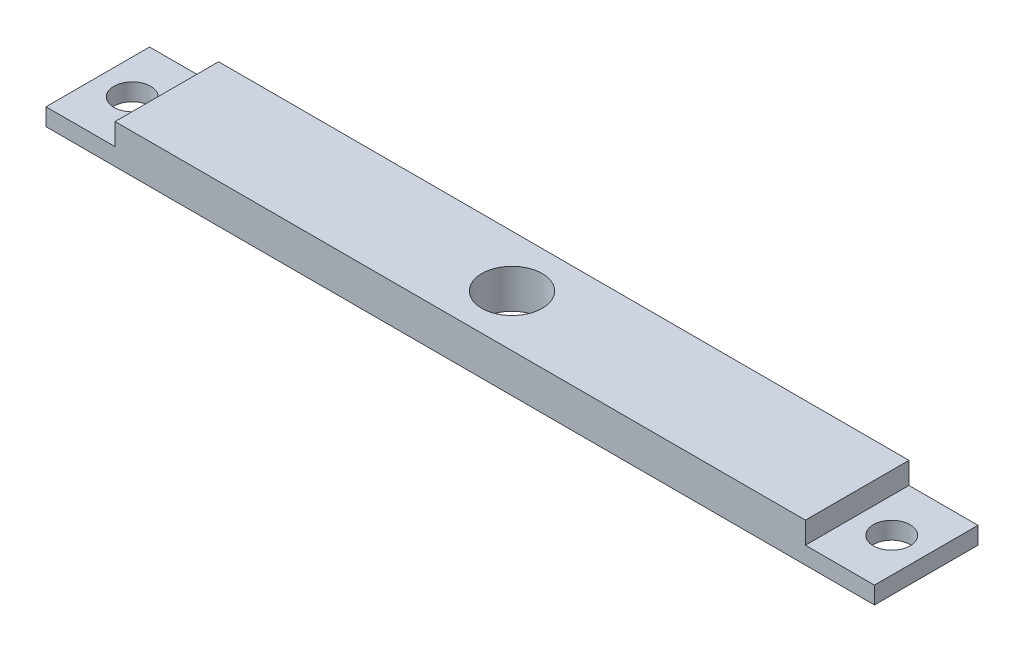
ISO-10303-21;
HEADER;
FILE_DESCRIPTION(('STEP AP214'),'2;1');
FILE_NAME('part.step','',(''),(''),'','','');
FILE_SCHEMA(('AUTOMOTIVE_DESIGN { 1 0 10303 214 1 1 1 1 }'));
ENDSEC;
DATA;
#1=APPLICATION_CONTEXT('core data for automotive mechanical design processes');
#2=APPLICATION_PROTOCOL_DEFINITION('international standard','automotive_design',2000,#1);
#3=PRODUCT_CONTEXT('',#1,'mechanical');
#4=PRODUCT('Part','Part','',(#3));
#5=PRODUCT_RELATED_PRODUCT_CATEGORY('part','',(#4));
#6=PRODUCT_DEFINITION_FORMATION('','',#4);
#7=PRODUCT_DEFINITION_CONTEXT('part definition',#1,'design');
#8=PRODUCT_DEFINITION('design','',#6,#7);
#9=PRODUCT_DEFINITION_SHAPE('','',#8);
#10=(LENGTH_UNIT() NAMED_UNIT(*) SI_UNIT(.MILLI.,.METRE.));
#11=(NAMED_UNIT(*) PLANE_ANGLE_UNIT() SI_UNIT($,.RADIAN.));
#12=(NAMED_UNIT(*) SI_UNIT($,.STERADIAN.) SOLID_ANGLE_UNIT());
#13=UNCERTAINTY_MEASURE_WITH_UNIT(LENGTH_MEASURE(1.E-05),#10,'distance_accuracy_value','');
#14=(GEOMETRIC_REPRESENTATION_CONTEXT(3) GLOBAL_UNCERTAINTY_ASSIGNED_CONTEXT((#13)) GLOBAL_UNIT_ASSIGNED_CONTEXT((#10,
#11,#12)) REPRESENTATION_CONTEXT('',''));
#15=CARTESIAN_POINT('',(0.,0.,0.));
#16=DIRECTION('',(0.,0.,1.));
#17=DIRECTION('',(1.,0.,0.));
#18=AXIS2_PLACEMENT_3D('',#15,#16,#17);
#19=CARTESIAN_POINT('',(-76.2,3.175,19.05));
#20=DIRECTION('',(1.,0.,0.));
#21=DIRECTION('',(0.,0.,-1.));
#22=AXIS2_PLACEMENT_3D('',#19,#20,#21);
#23=PLANE('',#22);
#24=DIRECTION('',(0.,-1.,0.));
#25=VECTOR('',#24,1.);
#26=CARTESIAN_POINT('',(-76.2,3.175,0.));
#27=LINE('',#26,#25);
#28=CARTESIAN_POINT('',(-76.2,3.175,0.));
#29=VERTEX_POINT('',#28);
#30=CARTESIAN_POINT('',(-76.2,0.,0.));
#31=VERTEX_POINT('',#30);
#32=EDGE_CURVE('E128',#29,#31,#27,.T.);
#33=ORIENTED_EDGE('',*,*,#32,.T.);
#34=DIRECTION('',(0.,0.,-1.));
#35=VECTOR('',#34,1.);
#36=CARTESIAN_POINT('',(-76.2,0.,19.05));
#37=LINE('',#36,#35);
#38=CARTESIAN_POINT('',(-76.2,0.,19.05));
#39=VERTEX_POINT('',#38);
#40=EDGE_CURVE('E11',#39,#31,#37,.T.);
#41=ORIENTED_EDGE('',*,*,#40,.F.);
#42=DIRECTION('',(0.,-1.,0.));
#43=VECTOR('',#42,1.);
#44=CARTESIAN_POINT('',(-76.2,3.175,19.05));
#45=LINE('',#44,#43);
#46=CARTESIAN_POINT('',(-76.2,3.175,19.05));
#47=VERTEX_POINT('',#46);
#48=EDGE_CURVE('E143',#47,#39,#45,.T.);
#49=ORIENTED_EDGE('',*,*,#48,.F.);
#50=DIRECTION('',(0.,0.,-1.));
#51=VECTOR('',#50,1.);
#52=CARTESIAN_POINT('',(-76.2,3.175,19.05));
#53=LINE('',#52,#51);
#54=EDGE_CURVE('E124',#47,#29,#53,.T.);
#55=ORIENTED_EDGE('',*,*,#54,.T.);
#56=EDGE_LOOP('',(#33,#41,#49,#55));
#57=FACE_BOUND('',#56,.T.);
#58=ADVANCED_FACE('F32',(#57),#23,.F.);
#59=CARTESIAN_POINT('',(-76.2,0.,19.05));
#60=DIRECTION('',(0.,1.,0.));
#61=DIRECTION('',(-1.,0.,0.));
#62=AXIS2_PLACEMENT_3D('',#59,#60,#61);
#63=PLANE('',#62);
#64=CARTESIAN_POINT('',(69.85,0.,9.525));
#65=DIRECTION('',(0.,1.,0.));
#66=DIRECTION('',(-1.,0.,0.));
#67=AXIS2_PLACEMENT_3D('',#64,#65,#66);
#68=CIRCLE('',#67,3.37819999999999);
#69=CARTESIAN_POINT('',(66.4718,0.,9.525));
#70=VERTEX_POINT('',#69);
#71=EDGE_CURVE('E185',#70,#70,#68,.T.);
#72=ORIENTED_EDGE('',*,*,#71,.T.);
#73=EDGE_LOOP('',(#72));
#74=FACE_BOUND('',#73,.T.);
#75=CARTESIAN_POINT('',(-69.85,0.,9.525));
#76=DIRECTION('',(0.,1.,0.));
#77=DIRECTION('',(-1.,0.,0.));
#78=AXIS2_PLACEMENT_3D('',#75,#76,#77);
#79=CIRCLE('',#78,3.37819999999999);
#80=CARTESIAN_POINT('',(-73.2282,0.,9.525));
#81=VERTEX_POINT('',#80);
#82=EDGE_CURVE('E179',#81,#81,#79,.T.);
#83=ORIENTED_EDGE('',*,*,#82,.T.);
#84=EDGE_LOOP('',(#83));
#85=FACE_BOUND('',#84,.T.);
#86=CARTESIAN_POINT('',(0.,0.,9.525));
#87=DIRECTION('',(0.,1.,0.));
#88=DIRECTION('',(-1.,0.,0.));
#89=AXIS2_PLACEMENT_3D('',#86,#87,#88);
#90=CIRCLE('',#89,5.55625);
#91=CARTESIAN_POINT('',(-5.55625,0.,9.525));
#92=VERTEX_POINT('',#91);
#93=EDGE_CURVE('E132',#92,#92,#90,.T.);
#94=ORIENTED_EDGE('',*,*,#93,.T.);
#95=EDGE_LOOP('',(#94));
#96=FACE_BOUND('',#95,.T.);
#97=DIRECTION('',(1.,0.,0.));
#98=VECTOR('',#97,1.);
#99=CARTESIAN_POINT('',(-76.2,0.,0.));
#100=LINE('',#99,#98);
#101=CARTESIAN_POINT('',(76.2,0.,0.));
#102=VERTEX_POINT('',#101);
#103=EDGE_CURVE('E131',#31,#102,#100,.T.);
#104=ORIENTED_EDGE('',*,*,#103,.T.);
#105=DIRECTION('',(0.,0.,-1.));
#106=VECTOR('',#105,1.);
#107=CARTESIAN_POINT('',(76.2,0.,19.05));
#108=LINE('',#107,#106);
#109=CARTESIAN_POINT('',(76.2,0.,19.05));
#110=VERTEX_POINT('',#109);
#111=EDGE_CURVE('E40',#110,#102,#108,.T.);
#112=ORIENTED_EDGE('',*,*,#111,.F.);
#113=DIRECTION('',(1.,0.,0.));
#114=VECTOR('',#113,1.);
#115=CARTESIAN_POINT('',(-76.2,0.,19.05));
#116=LINE('',#115,#114);
#117=EDGE_CURVE('E91',#39,#110,#116,.T.);
#118=ORIENTED_EDGE('',*,*,#117,.F.);
#119=ORIENTED_EDGE('',*,*,#40,.T.);
#120=EDGE_LOOP('',(#104,#112,#118,#119));
#121=FACE_BOUND('',#120,.T.);
#122=ADVANCED_FACE('F194',(#74,#85,#96,#121),#63,.F.);
#123=CARTESIAN_POINT('',(76.2,0.,19.05));
#124=DIRECTION('',(-1.,0.,0.));
#125=DIRECTION('',(0.,0.,1.));
#126=AXIS2_PLACEMENT_3D('',#123,#124,#125);
#127=PLANE('',#126);
#128=DIRECTION('',(0.,1.,0.));
#129=VECTOR('',#128,1.);
#130=CARTESIAN_POINT('',(76.2,0.,0.));
#131=LINE('',#130,#129);
#132=CARTESIAN_POINT('',(76.2,3.17500000000003,0.));
#133=VERTEX_POINT('',#132);
#134=EDGE_CURVE('E134',#102,#133,#131,.T.);
#135=ORIENTED_EDGE('',*,*,#134,.T.);
#136=DIRECTION('',(0.,0.,-1.));
#137=VECTOR('',#136,1.);
#138=CARTESIAN_POINT('',(76.2,3.17500000000003,19.05));
#139=LINE('',#138,#137);
#140=CARTESIAN_POINT('',(76.2,3.17500000000003,19.05));
#141=VERTEX_POINT('',#140);
#142=EDGE_CURVE('E150',#141,#133,#139,.T.);
#143=ORIENTED_EDGE('',*,*,#142,.F.);
#144=DIRECTION('',(0.,1.,0.));
#145=VECTOR('',#144,1.);
#146=CARTESIAN_POINT('',(76.2,0.,19.05));
#147=LINE('',#146,#145);
#148=EDGE_CURVE('E158',#110,#141,#147,.T.);
#149=ORIENTED_EDGE('',*,*,#148,.F.);
#150=ORIENTED_EDGE('',*,*,#111,.T.);
#151=EDGE_LOOP('',(#135,#143,#149,#150));
#152=FACE_BOUND('',#151,.T.);
#153=ADVANCED_FACE('F156',(#152),#127,.F.);
#154=CARTESIAN_POINT('',(76.2,3.17500000000003,19.05));
#155=DIRECTION('',(0.,-1.,0.));
#156=DIRECTION('',(1.,0.,0.));
#157=AXIS2_PLACEMENT_3D('',#154,#155,#156);
#158=PLANE('',#157);
#159=CARTESIAN_POINT('',(69.85,3.17500000000002,9.525));
#160=DIRECTION('',(0.,1.,0.));
#161=DIRECTION('',(-1.,0.,0.));
#162=AXIS2_PLACEMENT_3D('',#159,#160,#161);
#163=CIRCLE('',#162,3.37819999999999);
#164=CARTESIAN_POINT('',(66.4718,3.17500000000002,9.525));
#165=VERTEX_POINT('',#164);
#166=EDGE_CURVE('E188',#165,#165,#163,.T.);
#167=ORIENTED_EDGE('',*,*,#166,.F.);
#168=EDGE_LOOP('',(#167));
#169=FACE_BOUND('',#168,.T.);
#170=DIRECTION('',(-1.,0.,0.));
#171=VECTOR('',#170,1.);
#172=CARTESIAN_POINT('',(76.2,3.17500000000003,0.));
#173=LINE('',#172,#171);
#174=CARTESIAN_POINT('',(63.5,3.17500000000003,0.));
#175=VERTEX_POINT('',#174);
#176=EDGE_CURVE('E136',#133,#175,#173,.T.);
#177=ORIENTED_EDGE('',*,*,#176,.T.);
#178=DIRECTION('',(0.,0.,-1.));
#179=VECTOR('',#178,1.);
#180=CARTESIAN_POINT('',(63.5,3.17500000000003,19.05));
#181=LINE('',#180,#179);
#182=CARTESIAN_POINT('',(63.5,3.17500000000003,19.05));
#183=VERTEX_POINT('',#182);
#184=EDGE_CURVE('E147',#183,#175,#181,.T.);
#185=ORIENTED_EDGE('',*,*,#184,.F.);
#186=DIRECTION('',(-1.,0.,0.));
#187=VECTOR('',#186,1.);
#188=CARTESIAN_POINT('',(76.2,3.17500000000003,19.05));
#189=LINE('',#188,#187);
#190=EDGE_CURVE('E170',#141,#183,#189,.T.);
#191=ORIENTED_EDGE('',*,*,#190,.F.);
#192=ORIENTED_EDGE('',*,*,#142,.T.);
#193=EDGE_LOOP('',(#177,#185,#191,#192));
#194=FACE_BOUND('',#193,.T.);
#195=ADVANCED_FACE('F166',(#169,#194),#158,.F.);
#196=CARTESIAN_POINT('',(63.5,3.17500000000003,19.05));
#197=DIRECTION('',(-1.,0.,0.));
#198=DIRECTION('',(0.,0.,1.));
#199=AXIS2_PLACEMENT_3D('',#196,#197,#198);
#200=PLANE('',#199);
#201=DIRECTION('',(0.,1.,0.));
#202=VECTOR('',#201,1.);
#203=CARTESIAN_POINT('',(63.5,3.17500000000003,0.));
#204=LINE('',#203,#202);
#205=CARTESIAN_POINT('',(63.5,7.1755,0.));
#206=VERTEX_POINT('',#205);
#207=EDGE_CURVE('E138',#175,#206,#204,.T.);
#208=ORIENTED_EDGE('',*,*,#207,.T.);
#209=DIRECTION('',(0.,0.,-1.));
#210=VECTOR('',#209,1.);
#211=CARTESIAN_POINT('',(63.5,7.1755,19.05));
#212=LINE('',#211,#210);
#213=CARTESIAN_POINT('',(63.5,7.1755,19.05));
#214=VERTEX_POINT('',#213);
#215=EDGE_CURVE('E119',#214,#206,#212,.T.);
#216=ORIENTED_EDGE('',*,*,#215,.F.);
#217=DIRECTION('',(0.,1.,0.));
#218=VECTOR('',#217,1.);
#219=CARTESIAN_POINT('',(63.5,3.17500000000003,19.05));
#220=LINE('',#219,#218);
#221=EDGE_CURVE('E110',#183,#214,#220,.T.);
#222=ORIENTED_EDGE('',*,*,#221,.F.);
#223=ORIENTED_EDGE('',*,*,#184,.T.);
#224=EDGE_LOOP('',(#208,#216,#222,#223));
#225=FACE_BOUND('',#224,.T.);
#226=ADVANCED_FACE('F169',(#225),#200,.F.);
#227=CARTESIAN_POINT('',(63.5,7.1755,19.05));
#228=DIRECTION('',(0.,-1.,0.));
#229=DIRECTION('',(1.,0.,0.));
#230=AXIS2_PLACEMENT_3D('',#227,#228,#229);
#231=PLANE('',#230);
#232=CARTESIAN_POINT('',(0.,7.17549999999999,9.525));
#233=DIRECTION('',(0.,1.,0.));
#234=DIRECTION('',(-1.,0.,0.));
#235=AXIS2_PLACEMENT_3D('',#232,#233,#234);
#236=CIRCLE('',#235,5.55625);
#237=CARTESIAN_POINT('',(-5.55625,7.17549999999999,9.525));
#238=VERTEX_POINT('',#237);
#239=EDGE_CURVE('E176',#238,#238,#236,.T.);
#240=ORIENTED_EDGE('',*,*,#239,.F.);
#241=EDGE_LOOP('',(#240));
#242=FACE_BOUND('',#241,.T.);
#243=DIRECTION('',(-1.,0.,0.));
#244=VECTOR('',#243,1.);
#245=CARTESIAN_POINT('',(63.5,7.1755,0.));
#246=LINE('',#245,#244);
#247=CARTESIAN_POINT('',(-63.5,7.17549999999998,0.));
#248=VERTEX_POINT('',#247);
#249=EDGE_CURVE('E118',#206,#248,#246,.T.);
#250=ORIENTED_EDGE('',*,*,#249,.T.);
#251=DIRECTION('',(0.,0.,-1.));
#252=VECTOR('',#251,1.);
#253=CARTESIAN_POINT('',(-63.5,7.17549999999998,19.05));
#254=LINE('',#253,#252);
#255=CARTESIAN_POINT('',(-63.5,7.17549999999998,19.05));
#256=VERTEX_POINT('',#255);
#257=EDGE_CURVE('E115',#256,#248,#254,.T.);
#258=ORIENTED_EDGE('',*,*,#257,.F.);
#259=DIRECTION('',(-1.,0.,0.));
#260=VECTOR('',#259,1.);
#261=CARTESIAN_POINT('',(63.5,7.1755,19.05));
#262=LINE('',#261,#260);
#263=EDGE_CURVE('E104',#214,#256,#262,.T.);
#264=ORIENTED_EDGE('',*,*,#263,.F.);
#265=ORIENTED_EDGE('',*,*,#215,.T.);
#266=EDGE_LOOP('',(#250,#258,#264,#265));
#267=FACE_BOUND('',#266,.T.);
#268=ADVANCED_FACE('F116',(#242,#267),#231,.F.);
#269=CARTESIAN_POINT('',(-63.5,7.17549999999998,19.05));
#270=DIRECTION('',(1.,0.,0.));
#271=DIRECTION('',(0.,0.,-1.));
#272=AXIS2_PLACEMENT_3D('',#269,#270,#271);
#273=PLANE('',#272);
#274=DIRECTION('',(0.,-1.,0.));
#275=VECTOR('',#274,1.);
#276=CARTESIAN_POINT('',(-63.5,7.17549999999998,0.));
#277=LINE('',#276,#275);
#278=CARTESIAN_POINT('',(-63.5,3.175,0.));
#279=VERTEX_POINT('',#278);
#280=EDGE_CURVE('E77',#248,#279,#277,.T.);
#281=ORIENTED_EDGE('',*,*,#280,.T.);
#282=DIRECTION('',(0.,0.,-1.));
#283=VECTOR('',#282,1.);
#284=CARTESIAN_POINT('',(-63.5,3.175,19.05));
#285=LINE('',#284,#283);
#286=CARTESIAN_POINT('',(-63.5,3.175,19.05));
#287=VERTEX_POINT('',#286);
#288=EDGE_CURVE('E120',#287,#279,#285,.T.);
#289=ORIENTED_EDGE('',*,*,#288,.F.);
#290=DIRECTION('',(0.,-1.,0.));
#291=VECTOR('',#290,1.);
#292=CARTESIAN_POINT('',(-63.5,7.17549999999998,19.05));
#293=LINE('',#292,#291);
#294=EDGE_CURVE('E108',#256,#287,#293,.T.);
#295=ORIENTED_EDGE('',*,*,#294,.F.);
#296=ORIENTED_EDGE('',*,*,#257,.T.);
#297=EDGE_LOOP('',(#281,#289,#295,#296));
#298=FACE_BOUND('',#297,.T.);
#299=ADVANCED_FACE('F122',(#298),#273,.F.);
#300=CARTESIAN_POINT('',(-63.5,3.175,19.05));
#301=DIRECTION('',(0.,-1.,0.));
#302=DIRECTION('',(1.,0.,0.));
#303=AXIS2_PLACEMENT_3D('',#300,#301,#302);
#304=PLANE('',#303);
#305=CARTESIAN_POINT('',(-69.85,3.17500000000001,9.525));
#306=DIRECTION('',(0.,1.,0.));
#307=DIRECTION('',(-1.,0.,0.));
#308=AXIS2_PLACEMENT_3D('',#305,#306,#307);
#309=CIRCLE('',#308,3.37819999999999);
#310=CARTESIAN_POINT('',(-73.2282,3.17500000000001,9.525));
#311=VERTEX_POINT('',#310);
#312=EDGE_CURVE('E182',#311,#311,#309,.T.);
#313=ORIENTED_EDGE('',*,*,#312,.F.);
#314=EDGE_LOOP('',(#313));
#315=FACE_BOUND('',#314,.T.);
#316=DIRECTION('',(-1.,0.,0.));
#317=VECTOR('',#316,1.);
#318=CARTESIAN_POINT('',(-63.5,3.175,0.));
#319=LINE('',#318,#317);
#320=EDGE_CURVE('E83',#279,#29,#319,.T.);
#321=ORIENTED_EDGE('',*,*,#320,.T.);
#322=ORIENTED_EDGE('',*,*,#54,.F.);
#323=DIRECTION('',(-1.,0.,0.));
#324=VECTOR('',#323,1.);
#325=CARTESIAN_POINT('',(-63.5,3.175,19.05));
#326=LINE('',#325,#324);
#327=EDGE_CURVE('E48',#287,#47,#326,.T.);
#328=ORIENTED_EDGE('',*,*,#327,.F.);
#329=ORIENTED_EDGE('',*,*,#288,.T.);
#330=EDGE_LOOP('',(#321,#322,#328,#329));
#331=FACE_BOUND('',#330,.T.);
#332=ADVANCED_FACE('F219',(#315,#331),#304,.F.);
#333=CARTESIAN_POINT('',(0.,0.,19.05));
#334=DIRECTION('',(0.,0.,1.));
#335=DIRECTION('',(1.,0.,0.));
#336=AXIS2_PLACEMENT_3D('',#333,#334,#335);
#337=PLANE('',#336);
#338=ORIENTED_EDGE('',*,*,#48,.T.);
#339=ORIENTED_EDGE('',*,*,#117,.T.);
#340=ORIENTED_EDGE('',*,*,#148,.T.);
#341=ORIENTED_EDGE('',*,*,#190,.T.);
#342=ORIENTED_EDGE('',*,*,#221,.T.);
#343=ORIENTED_EDGE('',*,*,#263,.T.);
#344=ORIENTED_EDGE('',*,*,#294,.T.);
#345=ORIENTED_EDGE('',*,*,#327,.T.);
#346=EDGE_LOOP('',(#338,#339,#340,#341,#342,#343,#344,#345));
#347=FACE_BOUND('',#346,.T.);
#348=ADVANCED_FACE('F106',(#347),#337,.T.);
#349=CARTESIAN_POINT('',(0.,0.,0.));
#350=DIRECTION('',(0.,0.,1.));
#351=DIRECTION('',(1.,0.,0.));
#352=AXIS2_PLACEMENT_3D('',#349,#350,#351);
#353=PLANE('',#352);
#354=ORIENTED_EDGE('',*,*,#32,.F.);
#355=ORIENTED_EDGE('',*,*,#320,.F.);
#356=ORIENTED_EDGE('',*,*,#280,.F.);
#357=ORIENTED_EDGE('',*,*,#249,.F.);
#358=ORIENTED_EDGE('',*,*,#207,.F.);
#359=ORIENTED_EDGE('',*,*,#176,.F.);
#360=ORIENTED_EDGE('',*,*,#134,.F.);
#361=ORIENTED_EDGE('',*,*,#103,.F.);
#362=EDGE_LOOP('',(#354,#355,#356,#357,#358,#359,#360,#361));
#363=FACE_BOUND('',#362,.T.);
#364=ADVANCED_FACE('F162',(#363),#353,.F.);
#365=CARTESIAN_POINT('',(0.,0.,9.525));
#366=DIRECTION('',(0.,1.,0.));
#367=DIRECTION('',(-1.,0.,0.));
#368=AXIS2_PLACEMENT_3D('',#365,#366,#367);
#369=CYLINDRICAL_SURFACE('',#368,5.55625);
#370=ORIENTED_EDGE('',*,*,#93,.F.);
#371=EDGE_LOOP('',(#370));
#372=FACE_BOUND('',#371,.T.);
#373=ORIENTED_EDGE('',*,*,#239,.T.);
#374=EDGE_LOOP('',(#373));
#375=FACE_BOUND('',#374,.T.);
#376=ADVANCED_FACE('F238',(#372,#375),#369,.F.);
#377=CARTESIAN_POINT('',(-69.85,0.,9.525));
#378=DIRECTION('',(0.,1.,0.));
#379=DIRECTION('',(-1.,0.,0.));
#380=AXIS2_PLACEMENT_3D('',#377,#378,#379);
#381=CYLINDRICAL_SURFACE('',#380,3.37819999999999);
#382=ORIENTED_EDGE('',*,*,#82,.F.);
#383=EDGE_LOOP('',(#382));
#384=FACE_BOUND('',#383,.T.);
#385=ORIENTED_EDGE('',*,*,#312,.T.);
#386=EDGE_LOOP('',(#385));
#387=FACE_BOUND('',#386,.T.);
#388=ADVANCED_FACE('F200',(#384,#387),#381,.F.);
#389=CARTESIAN_POINT('',(69.85,0.,9.525));
#390=DIRECTION('',(0.,1.,0.));
#391=DIRECTION('',(-1.,0.,0.));
#392=AXIS2_PLACEMENT_3D('',#389,#390,#391);
#393=CYLINDRICAL_SURFACE('',#392,3.37819999999999);
#394=ORIENTED_EDGE('',*,*,#71,.F.);
#395=EDGE_LOOP('',(#394));
#396=FACE_BOUND('',#395,.T.);
#397=ORIENTED_EDGE('',*,*,#166,.T.);
#398=EDGE_LOOP('',(#397));
#399=FACE_BOUND('',#398,.T.);
#400=ADVANCED_FACE('F197',(#396,#399),#393,.F.);
#401=CLOSED_SHELL('',(#58,#122,#153,#195,#226,#268,#299,#332,#348,#364,#376,#388,#400));
#402=MANIFOLD_SOLID_BREP('B2',#401);
#403=ADVANCED_BREP_SHAPE_REPRESENTATION('',(#18,#402),#14);
#404=SHAPE_DEFINITION_REPRESENTATION(#9,#403);
ENDSEC;
END-ISO-10303-21;
